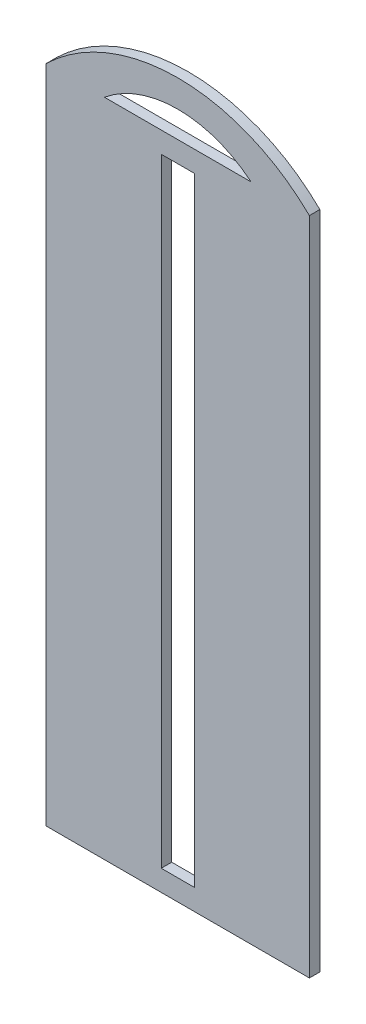
ISO-10303-21;
HEADER;
FILE_DESCRIPTION(('STEP AP214'),'2;1');
FILE_NAME('part.step','',(''),(''),'','','');
FILE_SCHEMA(('AUTOMOTIVE_DESIGN { 1 0 10303 214 1 1 1 1 }'));
ENDSEC;
DATA;
#1=APPLICATION_CONTEXT('core data for automotive mechanical design processes');
#2=APPLICATION_PROTOCOL_DEFINITION('international standard','automotive_design',2000,#1);
#3=PRODUCT_CONTEXT('',#1,'mechanical');
#4=PRODUCT('Part','Part','',(#3));
#5=PRODUCT_RELATED_PRODUCT_CATEGORY('part','',(#4));
#6=PRODUCT_DEFINITION_FORMATION('','',#4);
#7=PRODUCT_DEFINITION_CONTEXT('part definition',#1,'design');
#8=PRODUCT_DEFINITION('design','',#6,#7);
#9=PRODUCT_DEFINITION_SHAPE('','',#8);
#10=(LENGTH_UNIT() NAMED_UNIT(*) SI_UNIT(.MILLI.,.METRE.));
#11=(NAMED_UNIT(*) PLANE_ANGLE_UNIT() SI_UNIT($,.RADIAN.));
#12=(NAMED_UNIT(*) SI_UNIT($,.STERADIAN.) SOLID_ANGLE_UNIT());
#13=UNCERTAINTY_MEASURE_WITH_UNIT(LENGTH_MEASURE(1.E-05),#10,'distance_accuracy_value','');
#14=(GEOMETRIC_REPRESENTATION_CONTEXT(3) GLOBAL_UNCERTAINTY_ASSIGNED_CONTEXT((#13)) GLOBAL_UNIT_ASSIGNED_CONTEXT((#10,
#11,#12)) REPRESENTATION_CONTEXT('',''));
#15=CARTESIAN_POINT('',(0.,0.,0.));
#16=DIRECTION('',(0.,0.,1.));
#17=DIRECTION('',(1.,0.,0.));
#18=AXIS2_PLACEMENT_3D('',#15,#16,#17);
#19=CARTESIAN_POINT('',(0.,0.,-3.175));
#20=DIRECTION('',(-1.,0.,0.));
#21=DIRECTION('',(0.,0.,1.));
#22=AXIS2_PLACEMENT_3D('',#19,#20,#21);
#23=PLANE('',#22);
#24=DIRECTION('',(0.,-1.,0.));
#25=VECTOR('',#24,1.);
#26=CARTESIAN_POINT('',(0.,0.,0.));
#27=LINE('',#26,#25);
#28=CARTESIAN_POINT('',(0.,200.025,0.));
#29=VERTEX_POINT('',#28);
#30=CARTESIAN_POINT('',(0.,0.,0.));
#31=VERTEX_POINT('',#30);
#32=EDGE_CURVE('E167',#29,#31,#27,.T.);
#33=ORIENTED_EDGE('',*,*,#32,.F.);
#34=DIRECTION('',(0.,0.,1.));
#35=VECTOR('',#34,1.);
#36=CARTESIAN_POINT('',(0.,200.025,-3.175));
#37=LINE('',#36,#35);
#38=CARTESIAN_POINT('',(0.,200.025,-3.175));
#39=VERTEX_POINT('',#38);
#40=EDGE_CURVE('E11',#39,#29,#37,.T.);
#41=ORIENTED_EDGE('',*,*,#40,.F.);
#42=DIRECTION('',(0.,-1.,0.));
#43=VECTOR('',#42,1.);
#44=CARTESIAN_POINT('',(0.,0.,-3.175));
#45=LINE('',#44,#43);
#46=CARTESIAN_POINT('',(0.,0.,-3.175));
#47=VERTEX_POINT('',#46);
#48=EDGE_CURVE('E170',#39,#47,#45,.T.);
#49=ORIENTED_EDGE('',*,*,#48,.T.);
#50=DIRECTION('',(0.,0.,1.));
#51=VECTOR('',#50,1.);
#52=CARTESIAN_POINT('',(0.,0.,-3.175));
#53=LINE('',#52,#51);
#54=EDGE_CURVE('E43',#47,#31,#53,.T.);
#55=ORIENTED_EDGE('',*,*,#54,.T.);
#56=EDGE_LOOP('',(#33,#41,#49,#55));
#57=FACE_BOUND('',#56,.T.);
#58=ADVANCED_FACE('F40',(#57),#23,.T.);
#59=CARTESIAN_POINT('',(39.878,159.087637896415,-3.175));
#60=DIRECTION('',(0.,0.,1.));
#61=DIRECTION('',(1.,0.,0.));
#62=AXIS2_PLACEMENT_3D('',#59,#60,#61);
#63=CYLINDRICAL_SURFACE('',#62,57.15);
#64=CARTESIAN_POINT('',(39.878,159.087637896415,0.));
#65=DIRECTION('',(0.,0.,1.));
#66=DIRECTION('',(-1.,0.,0.));
#67=AXIS2_PLACEMENT_3D('',#64,#65,#66);
#68=CIRCLE('',#67,57.15);
#69=CARTESIAN_POINT('',(79.756,200.025,0.));
#70=VERTEX_POINT('',#69);
#71=EDGE_CURVE('E174',#70,#29,#68,.T.);
#72=ORIENTED_EDGE('',*,*,#71,.F.);
#73=DIRECTION('',(0.,0.,1.));
#74=VECTOR('',#73,1.);
#75=CARTESIAN_POINT('',(79.756,200.025,-3.175));
#76=LINE('',#75,#74);
#77=CARTESIAN_POINT('',(79.756,200.025,-3.175));
#78=VERTEX_POINT('',#77);
#79=EDGE_CURVE('E48',#78,#70,#76,.T.);
#80=ORIENTED_EDGE('',*,*,#79,.F.);
#81=CARTESIAN_POINT('',(39.878,159.087637896415,-3.175));
#82=DIRECTION('',(0.,0.,1.));
#83=DIRECTION('',(-1.,0.,0.));
#84=AXIS2_PLACEMENT_3D('',#81,#82,#83);
#85=CIRCLE('',#84,57.15);
#86=EDGE_CURVE('E180',#78,#39,#85,.T.);
#87=ORIENTED_EDGE('',*,*,#86,.T.);
#88=ORIENTED_EDGE('',*,*,#40,.T.);
#89=EDGE_LOOP('',(#72,#80,#87,#88));
#90=FACE_BOUND('',#89,.T.);
#91=ADVANCED_FACE('F206',(#90),#63,.T.);
#92=CARTESIAN_POINT('',(79.756,0.,-3.175));
#93=DIRECTION('',(1.,0.,0.));
#94=DIRECTION('',(0.,0.,-1.));
#95=AXIS2_PLACEMENT_3D('',#92,#93,#94);
#96=PLANE('',#95);
#97=DIRECTION('',(0.,1.,0.));
#98=VECTOR('',#97,1.);
#99=CARTESIAN_POINT('',(79.756,0.,0.));
#100=LINE('',#99,#98);
#101=CARTESIAN_POINT('',(79.756,0.,0.));
#102=VERTEX_POINT('',#101);
#103=EDGE_CURVE('E188',#102,#70,#100,.T.);
#104=ORIENTED_EDGE('',*,*,#103,.F.);
#105=DIRECTION('',(0.,0.,1.));
#106=VECTOR('',#105,1.);
#107=CARTESIAN_POINT('',(79.756,0.,-3.175));
#108=LINE('',#107,#106);
#109=CARTESIAN_POINT('',(79.756,0.,-3.175));
#110=VERTEX_POINT('',#109);
#111=EDGE_CURVE('E193',#110,#102,#108,.T.);
#112=ORIENTED_EDGE('',*,*,#111,.F.);
#113=DIRECTION('',(0.,1.,0.));
#114=VECTOR('',#113,1.);
#115=CARTESIAN_POINT('',(79.756,0.,-3.175));
#116=LINE('',#115,#114);
#117=EDGE_CURVE('E177',#110,#78,#116,.T.);
#118=ORIENTED_EDGE('',*,*,#117,.T.);
#119=ORIENTED_EDGE('',*,*,#79,.T.);
#120=EDGE_LOOP('',(#104,#112,#118,#119));
#121=FACE_BOUND('',#120,.T.);
#122=ADVANCED_FACE('F211',(#121),#96,.T.);
#123=CARTESIAN_POINT('',(0.,0.,-3.175));
#124=DIRECTION('',(0.,-1.,0.));
#125=DIRECTION('',(0.,0.,-1.));
#126=AXIS2_PLACEMENT_3D('',#123,#124,#125);
#127=PLANE('',#126);
#128=DIRECTION('',(1.,0.,0.));
#129=VECTOR('',#128,1.);
#130=CARTESIAN_POINT('',(0.,0.,0.));
#131=LINE('',#130,#129);
#132=EDGE_CURVE('E185',#31,#102,#131,.T.);
#133=ORIENTED_EDGE('',*,*,#132,.F.);
#134=ORIENTED_EDGE('',*,*,#54,.F.);
#135=DIRECTION('',(1.,0.,0.));
#136=VECTOR('',#135,1.);
#137=CARTESIAN_POINT('',(0.,0.,-3.175));
#138=LINE('',#137,#136);
#139=EDGE_CURVE('E173',#47,#110,#138,.T.);
#140=ORIENTED_EDGE('',*,*,#139,.T.);
#141=ORIENTED_EDGE('',*,*,#111,.T.);
#142=EDGE_LOOP('',(#133,#134,#140,#141));
#143=FACE_BOUND('',#142,.T.);
#144=ADVANCED_FACE('F201',(#143),#127,.T.);
#145=CARTESIAN_POINT('',(39.878,159.087637896415,-3.175));
#146=DIRECTION('',(0.,0.,-1.));
#147=DIRECTION('',(-1.,0.,0.));
#148=AXIS2_PLACEMENT_3D('',#145,#146,#147);
#149=PLANE('',#148);
#150=DIRECTION('',(0.,1.,0.));
#151=VECTOR('',#150,1.);
#152=CARTESIAN_POINT('',(44.878,6.35,-3.175));
#153=LINE('',#152,#151);
#154=CARTESIAN_POINT('',(44.878,6.35,-3.175));
#155=VERTEX_POINT('',#154);
#156=CARTESIAN_POINT('',(44.878,193.675,-3.175));
#157=VERTEX_POINT('',#156);
#158=EDGE_CURVE('E119',#155,#157,#153,.T.);
#159=ORIENTED_EDGE('',*,*,#158,.T.);
#160=DIRECTION('',(-1.,0.,0.));
#161=VECTOR('',#160,1.);
#162=CARTESIAN_POINT('',(34.878,193.675,-3.175));
#163=LINE('',#162,#161);
#164=CARTESIAN_POINT('',(34.878,193.675,-3.175));
#165=VERTEX_POINT('',#164);
#166=EDGE_CURVE('E128',#157,#165,#163,.T.);
#167=ORIENTED_EDGE('',*,*,#166,.T.);
#168=DIRECTION('',(0.,-1.,0.));
#169=VECTOR('',#168,1.);
#170=CARTESIAN_POINT('',(34.878,6.35,-3.175));
#171=LINE('',#170,#169);
#172=CARTESIAN_POINT('',(34.878,6.35,-3.175));
#173=VERTEX_POINT('',#172);
#174=EDGE_CURVE('E56',#165,#173,#171,.T.);
#175=ORIENTED_EDGE('',*,*,#174,.T.);
#176=DIRECTION('',(1.,0.,0.));
#177=VECTOR('',#176,1.);
#178=CARTESIAN_POINT('',(34.878,6.35,-3.175));
#179=LINE('',#178,#177);
#180=EDGE_CURVE('E125',#173,#155,#179,.T.);
#181=ORIENTED_EDGE('',*,*,#180,.T.);
#182=EDGE_LOOP('',(#159,#167,#175,#181));
#183=FACE_BOUND('',#182,.T.);
#184=CARTESIAN_POINT('',(39.878,173.084231636793,-3.175));
#185=DIRECTION('',(0.,0.,1.));
#186=DIRECTION('',(-1.,0.,0.));
#187=AXIS2_PLACEMENT_3D('',#184,#185,#186);
#188=CIRCLE('',#187,34.925);
#189=CARTESIAN_POINT('',(62.103,200.025,-3.175));
#190=VERTEX_POINT('',#189);
#191=CARTESIAN_POINT('',(17.653,200.025,-3.175));
#192=VERTEX_POINT('',#191);
#193=EDGE_CURVE('E154',#190,#192,#188,.T.);
#194=ORIENTED_EDGE('',*,*,#193,.T.);
#195=DIRECTION('',(1.,0.,0.));
#196=VECTOR('',#195,1.);
#197=CARTESIAN_POINT('',(17.653,200.025,-3.175));
#198=LINE('',#197,#196);
#199=EDGE_CURVE('E157',#192,#190,#198,.T.);
#200=ORIENTED_EDGE('',*,*,#199,.T.);
#201=EDGE_LOOP('',(#194,#200));
#202=FACE_BOUND('',#201,.T.);
#203=ORIENTED_EDGE('',*,*,#48,.F.);
#204=ORIENTED_EDGE('',*,*,#86,.F.);
#205=ORIENTED_EDGE('',*,*,#117,.F.);
#206=ORIENTED_EDGE('',*,*,#139,.F.);
#207=EDGE_LOOP('',(#203,#204,#205,#206));
#208=FACE_BOUND('',#207,.T.);
#209=ADVANCED_FACE('F132',(#183,#202,#208),#149,.T.);
#210=CARTESIAN_POINT('',(39.878,159.087637896415,0.));
#211=DIRECTION('',(0.,0.,-1.));
#212=DIRECTION('',(-1.,0.,0.));
#213=AXIS2_PLACEMENT_3D('',#210,#211,#212);
#214=PLANE('',#213);
#215=DIRECTION('',(-1.,0.,0.));
#216=VECTOR('',#215,1.);
#217=CARTESIAN_POINT('',(34.878,193.675,0.));
#218=LINE('',#217,#216);
#219=CARTESIAN_POINT('',(44.878,193.675,0.));
#220=VERTEX_POINT('',#219);
#221=CARTESIAN_POINT('',(34.878,193.675,0.));
#222=VERTEX_POINT('',#221);
#223=EDGE_CURVE('E144',#220,#222,#218,.T.);
#224=ORIENTED_EDGE('',*,*,#223,.F.);
#225=DIRECTION('',(0.,1.,0.));
#226=VECTOR('',#225,1.);
#227=CARTESIAN_POINT('',(44.878,6.35,0.));
#228=LINE('',#227,#226);
#229=CARTESIAN_POINT('',(44.878,6.35,0.));
#230=VERTEX_POINT('',#229);
#231=EDGE_CURVE('E64',#230,#220,#228,.T.);
#232=ORIENTED_EDGE('',*,*,#231,.F.);
#233=DIRECTION('',(1.,0.,0.));
#234=VECTOR('',#233,1.);
#235=CARTESIAN_POINT('',(34.878,6.35,0.));
#236=LINE('',#235,#234);
#237=CARTESIAN_POINT('',(34.878,6.35,0.));
#238=VERTEX_POINT('',#237);
#239=EDGE_CURVE('E135',#238,#230,#236,.T.);
#240=ORIENTED_EDGE('',*,*,#239,.F.);
#241=DIRECTION('',(0.,-1.,0.));
#242=VECTOR('',#241,1.);
#243=CARTESIAN_POINT('',(34.878,6.35,0.));
#244=LINE('',#243,#242);
#245=EDGE_CURVE('E138',#222,#238,#244,.T.);
#246=ORIENTED_EDGE('',*,*,#245,.F.);
#247=EDGE_LOOP('',(#224,#232,#240,#246));
#248=FACE_BOUND('',#247,.T.);
#249=DIRECTION('',(1.,0.,0.));
#250=VECTOR('',#249,1.);
#251=CARTESIAN_POINT('',(17.653,200.025,0.));
#252=LINE('',#251,#250);
#253=CARTESIAN_POINT('',(17.653,200.025,0.));
#254=VERTEX_POINT('',#253);
#255=CARTESIAN_POINT('',(62.103,200.025,0.));
#256=VERTEX_POINT('',#255);
#257=EDGE_CURVE('E158',#254,#256,#252,.T.);
#258=ORIENTED_EDGE('',*,*,#257,.F.);
#259=CARTESIAN_POINT('',(39.878,173.084231636793,0.));
#260=DIRECTION('',(0.,0.,1.));
#261=DIRECTION('',(-1.,0.,0.));
#262=AXIS2_PLACEMENT_3D('',#259,#260,#261);
#263=CIRCLE('',#262,34.925);
#264=EDGE_CURVE('E150',#256,#254,#263,.T.);
#265=ORIENTED_EDGE('',*,*,#264,.F.);
#266=EDGE_LOOP('',(#258,#265));
#267=FACE_BOUND('',#266,.T.);
#268=ORIENTED_EDGE('',*,*,#32,.T.);
#269=ORIENTED_EDGE('',*,*,#132,.T.);
#270=ORIENTED_EDGE('',*,*,#103,.T.);
#271=ORIENTED_EDGE('',*,*,#71,.T.);
#272=EDGE_LOOP('',(#268,#269,#270,#271));
#273=FACE_BOUND('',#272,.T.);
#274=ADVANCED_FACE('F203',(#248,#267,#273),#214,.F.);
#275=CARTESIAN_POINT('',(39.878,173.084231636793,-3.175));
#276=DIRECTION('',(0.,0.,1.));
#277=DIRECTION('',(1.,0.,0.));
#278=AXIS2_PLACEMENT_3D('',#275,#276,#277);
#279=CYLINDRICAL_SURFACE('',#278,34.925);
#280=ORIENTED_EDGE('',*,*,#264,.T.);
#281=DIRECTION('',(0.,0.,1.));
#282=VECTOR('',#281,1.);
#283=CARTESIAN_POINT('',(17.653,200.025,-3.175));
#284=LINE('',#283,#282);
#285=EDGE_CURVE('E161',#192,#254,#284,.T.);
#286=ORIENTED_EDGE('',*,*,#285,.F.);
#287=ORIENTED_EDGE('',*,*,#193,.F.);
#288=DIRECTION('',(0.,0.,1.));
#289=VECTOR('',#288,1.);
#290=CARTESIAN_POINT('',(62.103,200.025,-3.175));
#291=LINE('',#290,#289);
#292=EDGE_CURVE('E165',#190,#256,#291,.T.);
#293=ORIENTED_EDGE('',*,*,#292,.T.);
#294=EDGE_LOOP('',(#280,#286,#287,#293));
#295=FACE_BOUND('',#294,.T.);
#296=ADVANCED_FACE('F253',(#295),#279,.F.);
#297=CARTESIAN_POINT('',(17.653,200.025,-3.175));
#298=DIRECTION('',(0.,-1.,0.));
#299=DIRECTION('',(0.,0.,-1.));
#300=AXIS2_PLACEMENT_3D('',#297,#298,#299);
#301=PLANE('',#300);
#302=ORIENTED_EDGE('',*,*,#257,.T.);
#303=ORIENTED_EDGE('',*,*,#292,.F.);
#304=ORIENTED_EDGE('',*,*,#199,.F.);
#305=ORIENTED_EDGE('',*,*,#285,.T.);
#306=EDGE_LOOP('',(#302,#303,#304,#305));
#307=FACE_BOUND('',#306,.T.);
#308=ADVANCED_FACE('F263',(#307),#301,.F.);
#309=CARTESIAN_POINT('',(44.878,6.35,-3.175));
#310=DIRECTION('',(1.,0.,0.));
#311=DIRECTION('',(0.,1.,0.));
#312=AXIS2_PLACEMENT_3D('',#309,#310,#311);
#313=PLANE('',#312);
#314=ORIENTED_EDGE('',*,*,#231,.T.);
#315=DIRECTION('',(0.,0.,1.));
#316=VECTOR('',#315,1.);
#317=CARTESIAN_POINT('',(44.878,193.675,-3.175));
#318=LINE('',#317,#316);
#319=EDGE_CURVE('E115',#157,#220,#318,.T.);
#320=ORIENTED_EDGE('',*,*,#319,.F.);
#321=ORIENTED_EDGE('',*,*,#158,.F.);
#322=DIRECTION('',(0.,0.,1.));
#323=VECTOR('',#322,1.);
#324=CARTESIAN_POINT('',(44.878,6.35,-3.175));
#325=LINE('',#324,#323);
#326=EDGE_CURVE('E148',#155,#230,#325,.T.);
#327=ORIENTED_EDGE('',*,*,#326,.T.);
#328=EDGE_LOOP('',(#314,#320,#321,#327));
#329=FACE_BOUND('',#328,.T.);
#330=ADVANCED_FACE('F117',(#329),#313,.F.);
#331=CARTESIAN_POINT('',(34.878,6.35,-3.175));
#332=DIRECTION('',(0.,-1.,0.));
#333=DIRECTION('',(0.,0.,-1.));
#334=AXIS2_PLACEMENT_3D('',#331,#332,#333);
#335=PLANE('',#334);
#336=ORIENTED_EDGE('',*,*,#239,.T.);
#337=ORIENTED_EDGE('',*,*,#326,.F.);
#338=ORIENTED_EDGE('',*,*,#180,.F.);
#339=DIRECTION('',(0.,0.,1.));
#340=VECTOR('',#339,1.);
#341=CARTESIAN_POINT('',(34.878,6.35,-3.175));
#342=LINE('',#341,#340);
#343=EDGE_CURVE('E151',#173,#238,#342,.T.);
#344=ORIENTED_EDGE('',*,*,#343,.T.);
#345=EDGE_LOOP('',(#336,#337,#338,#344));
#346=FACE_BOUND('',#345,.T.);
#347=ADVANCED_FACE('F282',(#346),#335,.F.);
#348=CARTESIAN_POINT('',(34.878,6.35,-3.175));
#349=DIRECTION('',(-1.,0.,0.));
#350=DIRECTION('',(0.,0.,1.));
#351=AXIS2_PLACEMENT_3D('',#348,#349,#350);
#352=PLANE('',#351);
#353=ORIENTED_EDGE('',*,*,#245,.T.);
#354=ORIENTED_EDGE('',*,*,#343,.F.);
#355=ORIENTED_EDGE('',*,*,#174,.F.);
#356=DIRECTION('',(0.,0.,1.));
#357=VECTOR('',#356,1.);
#358=CARTESIAN_POINT('',(34.878,193.675,-3.175));
#359=LINE('',#358,#357);
#360=EDGE_CURVE('E124',#165,#222,#359,.T.);
#361=ORIENTED_EDGE('',*,*,#360,.T.);
#362=EDGE_LOOP('',(#353,#354,#355,#361));
#363=FACE_BOUND('',#362,.T.);
#364=ADVANCED_FACE('F291',(#363),#352,.F.);
#365=CARTESIAN_POINT('',(34.878,193.675,-3.175));
#366=DIRECTION('',(0.,1.,0.));
#367=DIRECTION('',(0.,0.,1.));
#368=AXIS2_PLACEMENT_3D('',#365,#366,#367);
#369=PLANE('',#368);
#370=ORIENTED_EDGE('',*,*,#223,.T.);
#371=ORIENTED_EDGE('',*,*,#360,.F.);
#372=ORIENTED_EDGE('',*,*,#166,.F.);
#373=ORIENTED_EDGE('',*,*,#319,.T.);
#374=EDGE_LOOP('',(#370,#371,#372,#373));
#375=FACE_BOUND('',#374,.T.);
#376=ADVANCED_FACE('F129',(#375),#369,.F.);
#377=CLOSED_SHELL('',(#58,#91,#122,#144,#209,#274,#296,#308,#330,#347,#364,#376));
#378=MANIFOLD_SOLID_BREP('B2',#377);
#379=ADVANCED_BREP_SHAPE_REPRESENTATION('',(#18,#378),#14);
#380=SHAPE_DEFINITION_REPRESENTATION(#9,#379);
ENDSEC;
END-ISO-10303-21;
